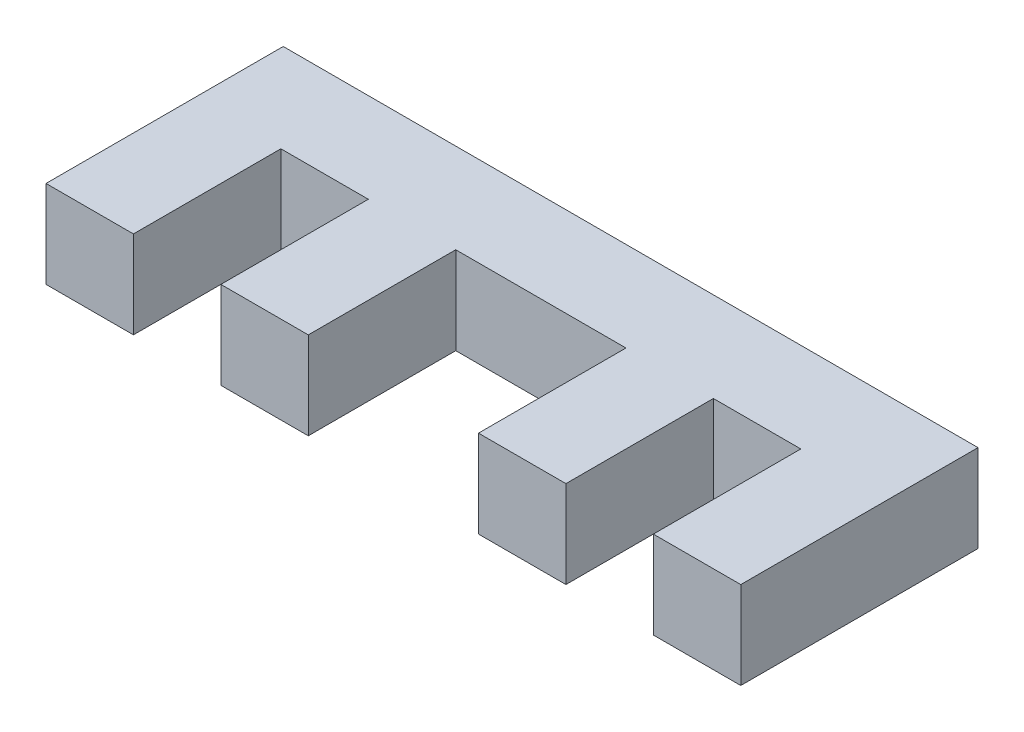
ISO-10303-21;
HEADER;
FILE_DESCRIPTION(('STEP AP214'),'2;1');
FILE_NAME('part.step','',(''),(''),'','','');
FILE_SCHEMA(('AUTOMOTIVE_DESIGN { 1 0 10303 214 1 1 1 1 }'));
ENDSEC;
DATA;
#1=APPLICATION_CONTEXT('core data for automotive mechanical design processes');
#2=APPLICATION_PROTOCOL_DEFINITION('international standard','automotive_design',2000,#1);
#3=PRODUCT_CONTEXT('',#1,'mechanical');
#4=PRODUCT('Part','Part','',(#3));
#5=PRODUCT_RELATED_PRODUCT_CATEGORY('part','',(#4));
#6=PRODUCT_DEFINITION_FORMATION('','',#4);
#7=PRODUCT_DEFINITION_CONTEXT('part definition',#1,'design');
#8=PRODUCT_DEFINITION('design','',#6,#7);
#9=PRODUCT_DEFINITION_SHAPE('','',#8);
#10=(LENGTH_UNIT() NAMED_UNIT(*) SI_UNIT(.MILLI.,.METRE.));
#11=(NAMED_UNIT(*) PLANE_ANGLE_UNIT() SI_UNIT($,.RADIAN.));
#12=(NAMED_UNIT(*) SI_UNIT($,.STERADIAN.) SOLID_ANGLE_UNIT());
#13=UNCERTAINTY_MEASURE_WITH_UNIT(LENGTH_MEASURE(1.E-05),#10,'distance_accuracy_value','');
#14=(GEOMETRIC_REPRESENTATION_CONTEXT(3) GLOBAL_UNCERTAINTY_ASSIGNED_CONTEXT((#13)) GLOBAL_UNIT_ASSIGNED_CONTEXT((#10,
#11,#12)) REPRESENTATION_CONTEXT('',''));
#15=CARTESIAN_POINT('',(0.,0.,0.));
#16=DIRECTION('',(0.,0.,1.));
#17=DIRECTION('',(1.,0.,0.));
#18=AXIS2_PLACEMENT_3D('',#15,#16,#17);
#19=CARTESIAN_POINT('',(0.,3.175,-8.61483333333333));
#20=DIRECTION('',(1.,0.,0.));
#21=DIRECTION('',(0.,0.,-1.));
#22=AXIS2_PLACEMENT_3D('',#19,#20,#21);
#23=PLANE('',#22);
#24=DIRECTION('',(0.,0.,1.));
#25=VECTOR('',#24,1.);
#26=CARTESIAN_POINT('',(0.,0.,-8.61483333333333));
#27=LINE('',#26,#25);
#28=CARTESIAN_POINT('',(0.,0.,-8.61483333333333));
#29=VERTEX_POINT('',#28);
#30=CARTESIAN_POINT('',(0.,0.,0.));
#31=VERTEX_POINT('',#30);
#32=EDGE_CURVE('E180',#29,#31,#27,.T.);
#33=ORIENTED_EDGE('',*,*,#32,.T.);
#34=DIRECTION('',(0.,-1.,0.));
#35=VECTOR('',#34,1.);
#36=CARTESIAN_POINT('',(0.,3.175,0.));
#37=LINE('',#36,#35);
#38=CARTESIAN_POINT('',(0.,3.175,0.));
#39=VERTEX_POINT('',#38);
#40=EDGE_CURVE('E11',#39,#31,#37,.T.);
#41=ORIENTED_EDGE('',*,*,#40,.F.);
#42=DIRECTION('',(0.,0.,1.));
#43=VECTOR('',#42,1.);
#44=CARTESIAN_POINT('',(0.,3.175,-8.61483333333333));
#45=LINE('',#44,#43);
#46=CARTESIAN_POINT('',(0.,3.175,-8.61483333333333));
#47=VERTEX_POINT('',#46);
#48=EDGE_CURVE('E210',#47,#39,#45,.T.);
#49=ORIENTED_EDGE('',*,*,#48,.F.);
#50=DIRECTION('',(0.,-1.,0.));
#51=VECTOR('',#50,1.);
#52=CARTESIAN_POINT('',(0.,3.175,-8.61483333333333));
#53=LINE('',#52,#51);
#54=EDGE_CURVE('E176',#47,#29,#53,.T.);
#55=ORIENTED_EDGE('',*,*,#54,.T.);
#56=EDGE_LOOP('',(#33,#41,#49,#55));
#57=FACE_BOUND('',#56,.T.);
#58=ADVANCED_FACE('F36',(#57),#23,.F.);
#59=CARTESIAN_POINT('',(0.,3.175,0.));
#60=DIRECTION('',(0.,0.,-1.));
#61=DIRECTION('',(-1.,0.,0.));
#62=AXIS2_PLACEMENT_3D('',#59,#60,#61);
#63=PLANE('',#62);
#64=DIRECTION('',(1.,0.,0.));
#65=VECTOR('',#64,1.);
#66=CARTESIAN_POINT('',(0.,0.,0.));
#67=LINE('',#66,#65);
#68=CARTESIAN_POINT('',(3.175,0.,0.));
#69=VERTEX_POINT('',#68);
#70=EDGE_CURVE('E183',#31,#69,#67,.T.);
#71=ORIENTED_EDGE('',*,*,#70,.T.);
#72=DIRECTION('',(0.,-1.,0.));
#73=VECTOR('',#72,1.);
#74=CARTESIAN_POINT('',(3.175,3.175,0.));
#75=LINE('',#74,#73);
#76=CARTESIAN_POINT('',(3.175,3.175,0.));
#77=VERTEX_POINT('',#76);
#78=EDGE_CURVE('E44',#77,#69,#75,.T.);
#79=ORIENTED_EDGE('',*,*,#78,.F.);
#80=DIRECTION('',(1.,0.,0.));
#81=VECTOR('',#80,1.);
#82=CARTESIAN_POINT('',(0.,3.175,0.));
#83=LINE('',#82,#81);
#84=EDGE_CURVE('E119',#39,#77,#83,.T.);
#85=ORIENTED_EDGE('',*,*,#84,.F.);
#86=ORIENTED_EDGE('',*,*,#40,.T.);
#87=EDGE_LOOP('',(#71,#79,#85,#86));
#88=FACE_BOUND('',#87,.T.);
#89=ADVANCED_FACE('F308',(#88),#63,.F.);
#90=CARTESIAN_POINT('',(3.175,3.175,0.));
#91=DIRECTION('',(-1.,0.,0.));
#92=DIRECTION('',(0.,0.,1.));
#93=AXIS2_PLACEMENT_3D('',#90,#91,#92);
#94=PLANE('',#93);
#95=DIRECTION('',(0.,0.,-1.));
#96=VECTOR('',#95,1.);
#97=CARTESIAN_POINT('',(3.175,0.,0.));
#98=LINE('',#97,#96);
#99=CARTESIAN_POINT('',(3.175,0.,-5.35516666666666));
#100=VERTEX_POINT('',#99);
#101=EDGE_CURVE('E185',#69,#100,#98,.T.);
#102=ORIENTED_EDGE('',*,*,#101,.T.);
#103=DIRECTION('',(0.,-1.,0.));
#104=VECTOR('',#103,1.);
#105=CARTESIAN_POINT('',(3.175,3.175,-5.35516666666666));
#106=LINE('',#105,#104);
#107=CARTESIAN_POINT('',(3.175,3.175,-5.35516666666666));
#108=VERTEX_POINT('',#107);
#109=EDGE_CURVE('E241',#108,#100,#106,.T.);
#110=ORIENTED_EDGE('',*,*,#109,.F.);
#111=DIRECTION('',(0.,0.,-1.));
#112=VECTOR('',#111,1.);
#113=CARTESIAN_POINT('',(3.175,3.175,0.));
#114=LINE('',#113,#112);
#115=EDGE_CURVE('E249',#77,#108,#114,.T.);
#116=ORIENTED_EDGE('',*,*,#115,.F.);
#117=ORIENTED_EDGE('',*,*,#78,.T.);
#118=EDGE_LOOP('',(#102,#110,#116,#117));
#119=FACE_BOUND('',#118,.T.);
#120=ADVANCED_FACE('F247',(#119),#94,.F.);
#121=CARTESIAN_POINT('',(3.175,3.175,-5.35516666666666));
#122=DIRECTION('',(0.,0.,-1.));
#123=DIRECTION('',(-1.,0.,0.));
#124=AXIS2_PLACEMENT_3D('',#121,#122,#123);
#125=PLANE('',#124);
#126=DIRECTION('',(1.,0.,0.));
#127=VECTOR('',#126,1.);
#128=CARTESIAN_POINT('',(3.175,0.,-5.35516666666666));
#129=LINE('',#128,#127);
#130=CARTESIAN_POINT('',(6.35,0.,-5.35516666666666));
#131=VERTEX_POINT('',#130);
#132=EDGE_CURVE('E187',#100,#131,#129,.T.);
#133=ORIENTED_EDGE('',*,*,#132,.T.);
#134=DIRECTION('',(0.,-1.,0.));
#135=VECTOR('',#134,1.);
#136=CARTESIAN_POINT('',(6.35,3.175,-5.35516666666666));
#137=LINE('',#136,#135);
#138=CARTESIAN_POINT('',(6.35,3.175,-5.35516666666666));
#139=VERTEX_POINT('',#138);
#140=EDGE_CURVE('E238',#139,#131,#137,.T.);
#141=ORIENTED_EDGE('',*,*,#140,.F.);
#142=DIRECTION('',(1.,0.,0.));
#143=VECTOR('',#142,1.);
#144=CARTESIAN_POINT('',(3.175,3.175,-5.35516666666666));
#145=LINE('',#144,#143);
#146=EDGE_CURVE('E267',#108,#139,#145,.T.);
#147=ORIENTED_EDGE('',*,*,#146,.F.);
#148=ORIENTED_EDGE('',*,*,#109,.T.);
#149=EDGE_LOOP('',(#133,#141,#147,#148));
#150=FACE_BOUND('',#149,.T.);
#151=ADVANCED_FACE('F258',(#150),#125,.F.);
#152=CARTESIAN_POINT('',(6.35,3.175,-5.35516666666666));
#153=DIRECTION('',(1.,0.,0.));
#154=DIRECTION('',(0.,0.,-1.));
#155=AXIS2_PLACEMENT_3D('',#152,#153,#154);
#156=PLANE('',#155);
#157=DIRECTION('',(0.,0.,1.));
#158=VECTOR('',#157,1.);
#159=CARTESIAN_POINT('',(6.35,0.,-5.35516666666666));
#160=LINE('',#159,#158);
#161=CARTESIAN_POINT('',(6.35,0.,0.));
#162=VERTEX_POINT('',#161);
#163=EDGE_CURVE('E189',#131,#162,#160,.T.);
#164=ORIENTED_EDGE('',*,*,#163,.T.);
#165=DIRECTION('',(0.,-1.,0.));
#166=VECTOR('',#165,1.);
#167=CARTESIAN_POINT('',(6.35,3.175,0.));
#168=LINE('',#167,#166);
#169=CARTESIAN_POINT('',(6.35,3.175,0.));
#170=VERTEX_POINT('',#169);
#171=EDGE_CURVE('E235',#170,#162,#168,.T.);
#172=ORIENTED_EDGE('',*,*,#171,.F.);
#173=DIRECTION('',(0.,0.,1.));
#174=VECTOR('',#173,1.);
#175=CARTESIAN_POINT('',(6.35,3.175,-5.35516666666666));
#176=LINE('',#175,#174);
#177=EDGE_CURVE('E264',#139,#170,#176,.T.);
#178=ORIENTED_EDGE('',*,*,#177,.F.);
#179=ORIENTED_EDGE('',*,*,#140,.T.);
#180=EDGE_LOOP('',(#164,#172,#178,#179));
#181=FACE_BOUND('',#180,.T.);
#182=ADVANCED_FACE('F262',(#181),#156,.F.);
#183=CARTESIAN_POINT('',(6.35,3.175,0.));
#184=DIRECTION('',(0.,0.,-1.));
#185=DIRECTION('',(-1.,0.,0.));
#186=AXIS2_PLACEMENT_3D('',#183,#184,#185);
#187=PLANE('',#186);
#188=DIRECTION('',(1.,0.,0.));
#189=VECTOR('',#188,1.);
#190=CARTESIAN_POINT('',(6.35,0.,0.));
#191=LINE('',#190,#189);
#192=CARTESIAN_POINT('',(9.525,0.,0.));
#193=VERTEX_POINT('',#192);
#194=EDGE_CURVE('E191',#162,#193,#191,.T.);
#195=ORIENTED_EDGE('',*,*,#194,.T.);
#196=DIRECTION('',(0.,-1.,0.));
#197=VECTOR('',#196,1.);
#198=CARTESIAN_POINT('',(9.525,3.175,0.));
#199=LINE('',#198,#197);
#200=CARTESIAN_POINT('',(9.525,3.175,0.));
#201=VERTEX_POINT('',#200);
#202=EDGE_CURVE('E232',#201,#193,#199,.T.);
#203=ORIENTED_EDGE('',*,*,#202,.F.);
#204=DIRECTION('',(1.,0.,0.));
#205=VECTOR('',#204,1.);
#206=CARTESIAN_POINT('',(6.35,3.175,0.));
#207=LINE('',#206,#205);
#208=EDGE_CURVE('E266',#170,#201,#207,.T.);
#209=ORIENTED_EDGE('',*,*,#208,.F.);
#210=ORIENTED_EDGE('',*,*,#171,.T.);
#211=EDGE_LOOP('',(#195,#203,#209,#210));
#212=FACE_BOUND('',#211,.T.);
#213=ADVANCED_FACE('F321',(#212),#187,.F.);
#214=CARTESIAN_POINT('',(9.525,3.175,0.));
#215=DIRECTION('',(-1.,0.,0.));
#216=DIRECTION('',(0.,0.,1.));
#217=AXIS2_PLACEMENT_3D('',#214,#215,#216);
#218=PLANE('',#217);
#219=DIRECTION('',(0.,0.,-1.));
#220=VECTOR('',#219,1.);
#221=CARTESIAN_POINT('',(9.525,0.,0.));
#222=LINE('',#221,#220);
#223=CARTESIAN_POINT('',(9.525,0.,-5.35516666666666));
#224=VERTEX_POINT('',#223);
#225=EDGE_CURVE('E193',#193,#224,#222,.T.);
#226=ORIENTED_EDGE('',*,*,#225,.T.);
#227=DIRECTION('',(0.,-1.,0.));
#228=VECTOR('',#227,1.);
#229=CARTESIAN_POINT('',(9.525,3.175,-5.35516666666666));
#230=LINE('',#229,#228);
#231=CARTESIAN_POINT('',(9.525,3.175,-5.35516666666666));
#232=VERTEX_POINT('',#231);
#233=EDGE_CURVE('E229',#232,#224,#230,.T.);
#234=ORIENTED_EDGE('',*,*,#233,.F.);
#235=DIRECTION('',(0.,0.,-1.));
#236=VECTOR('',#235,1.);
#237=CARTESIAN_POINT('',(9.525,3.175,0.));
#238=LINE('',#237,#236);
#239=EDGE_CURVE('E269',#201,#232,#238,.T.);
#240=ORIENTED_EDGE('',*,*,#239,.F.);
#241=ORIENTED_EDGE('',*,*,#202,.T.);
#242=EDGE_LOOP('',(#226,#234,#240,#241));
#243=FACE_BOUND('',#242,.T.);
#244=ADVANCED_FACE('F324',(#243),#218,.F.);
#245=CARTESIAN_POINT('',(9.525,3.175,-5.35516666666666));
#246=DIRECTION('',(0.,0.,-1.));
#247=DIRECTION('',(-1.,0.,0.));
#248=AXIS2_PLACEMENT_3D('',#245,#246,#247);
#249=PLANE('',#248);
#250=DIRECTION('',(1.,0.,0.));
#251=VECTOR('',#250,1.);
#252=CARTESIAN_POINT('',(9.525,0.,-5.35516666666666));
#253=LINE('',#252,#251);
#254=CARTESIAN_POINT('',(15.7056666666667,0.,-5.35516666666666));
#255=VERTEX_POINT('',#254);
#256=EDGE_CURVE('E195',#224,#255,#253,.T.);
#257=ORIENTED_EDGE('',*,*,#256,.T.);
#258=DIRECTION('',(0.,-1.,0.));
#259=VECTOR('',#258,1.);
#260=CARTESIAN_POINT('',(15.7056666666667,3.175,-5.35516666666666));
#261=LINE('',#260,#259);
#262=CARTESIAN_POINT('',(15.7056666666667,3.175,-5.35516666666666));
#263=VERTEX_POINT('',#262);
#264=EDGE_CURVE('E226',#263,#255,#261,.T.);
#265=ORIENTED_EDGE('',*,*,#264,.F.);
#266=DIRECTION('',(1.,0.,0.));
#267=VECTOR('',#266,1.);
#268=CARTESIAN_POINT('',(9.525,3.175,-5.35516666666666));
#269=LINE('',#268,#267);
#270=EDGE_CURVE('E275',#232,#263,#269,.T.);
#271=ORIENTED_EDGE('',*,*,#270,.F.);
#272=ORIENTED_EDGE('',*,*,#233,.T.);
#273=EDGE_LOOP('',(#257,#265,#271,#272));
#274=FACE_BOUND('',#273,.T.);
#275=ADVANCED_FACE('F328',(#274),#249,.F.);
#276=CARTESIAN_POINT('',(15.7056666666667,3.175,-5.35516666666666));
#277=DIRECTION('',(1.,0.,0.));
#278=DIRECTION('',(0.,0.,-1.));
#279=AXIS2_PLACEMENT_3D('',#276,#277,#278);
#280=PLANE('',#279);
#281=DIRECTION('',(0.,0.,1.));
#282=VECTOR('',#281,1.);
#283=CARTESIAN_POINT('',(15.7056666666667,0.,-5.35516666666666));
#284=LINE('',#283,#282);
#285=CARTESIAN_POINT('',(15.7056666666667,0.,0.));
#286=VERTEX_POINT('',#285);
#287=EDGE_CURVE('E197',#255,#286,#284,.T.);
#288=ORIENTED_EDGE('',*,*,#287,.T.);
#289=DIRECTION('',(0.,-1.,0.));
#290=VECTOR('',#289,1.);
#291=CARTESIAN_POINT('',(15.7056666666667,3.175,0.));
#292=LINE('',#291,#290);
#293=CARTESIAN_POINT('',(15.7056666666667,3.175,0.));
#294=VERTEX_POINT('',#293);
#295=EDGE_CURVE('E223',#294,#286,#292,.T.);
#296=ORIENTED_EDGE('',*,*,#295,.F.);
#297=DIRECTION('',(0.,0.,1.));
#298=VECTOR('',#297,1.);
#299=CARTESIAN_POINT('',(15.7056666666667,3.175,-5.35516666666666));
#300=LINE('',#299,#298);
#301=EDGE_CURVE('E277',#263,#294,#300,.T.);
#302=ORIENTED_EDGE('',*,*,#301,.F.);
#303=ORIENTED_EDGE('',*,*,#264,.T.);
#304=EDGE_LOOP('',(#288,#296,#302,#303));
#305=FACE_BOUND('',#304,.T.);
#306=ADVANCED_FACE('F332',(#305),#280,.F.);
#307=CARTESIAN_POINT('',(15.7056666666667,3.175,0.));
#308=DIRECTION('',(0.,0.,-1.));
#309=DIRECTION('',(-1.,0.,0.));
#310=AXIS2_PLACEMENT_3D('',#307,#308,#309);
#311=PLANE('',#310);
#312=DIRECTION('',(1.,0.,0.));
#313=VECTOR('',#312,1.);
#314=CARTESIAN_POINT('',(15.7056666666667,0.,0.));
#315=LINE('',#314,#313);
#316=CARTESIAN_POINT('',(18.8806666666667,0.,0.));
#317=VERTEX_POINT('',#316);
#318=EDGE_CURVE('E199',#286,#317,#315,.T.);
#319=ORIENTED_EDGE('',*,*,#318,.T.);
#320=DIRECTION('',(0.,-1.,0.));
#321=VECTOR('',#320,1.);
#322=CARTESIAN_POINT('',(18.8806666666667,3.175,0.));
#323=LINE('',#322,#321);
#324=CARTESIAN_POINT('',(18.8806666666667,3.175,0.));
#325=VERTEX_POINT('',#324);
#326=EDGE_CURVE('E220',#325,#317,#323,.T.);
#327=ORIENTED_EDGE('',*,*,#326,.F.);
#328=DIRECTION('',(1.,0.,0.));
#329=VECTOR('',#328,1.);
#330=CARTESIAN_POINT('',(15.7056666666667,3.175,0.));
#331=LINE('',#330,#329);
#332=EDGE_CURVE('E279',#294,#325,#331,.T.);
#333=ORIENTED_EDGE('',*,*,#332,.F.);
#334=ORIENTED_EDGE('',*,*,#295,.T.);
#335=EDGE_LOOP('',(#319,#327,#333,#334));
#336=FACE_BOUND('',#335,.T.);
#337=ADVANCED_FACE('F336',(#336),#311,.F.);
#338=CARTESIAN_POINT('',(18.8806666666667,3.175,0.));
#339=DIRECTION('',(-1.,0.,0.));
#340=DIRECTION('',(0.,0.,1.));
#341=AXIS2_PLACEMENT_3D('',#338,#339,#340);
#342=PLANE('',#341);
#343=DIRECTION('',(0.,0.,-1.));
#344=VECTOR('',#343,1.);
#345=CARTESIAN_POINT('',(18.8806666666667,0.,0.));
#346=LINE('',#345,#344);
#347=CARTESIAN_POINT('',(18.8806666666667,0.,-5.35516666666666));
#348=VERTEX_POINT('',#347);
#349=EDGE_CURVE('E201',#317,#348,#346,.T.);
#350=ORIENTED_EDGE('',*,*,#349,.T.);
#351=DIRECTION('',(0.,-1.,0.));
#352=VECTOR('',#351,1.);
#353=CARTESIAN_POINT('',(18.8806666666667,3.175,-5.35516666666666));
#354=LINE('',#353,#352);
#355=CARTESIAN_POINT('',(18.8806666666667,3.175,-5.35516666666666));
#356=VERTEX_POINT('',#355);
#357=EDGE_CURVE('E217',#356,#348,#354,.T.);
#358=ORIENTED_EDGE('',*,*,#357,.F.);
#359=DIRECTION('',(0.,0.,-1.));
#360=VECTOR('',#359,1.);
#361=CARTESIAN_POINT('',(18.8806666666667,3.175,0.));
#362=LINE('',#361,#360);
#363=EDGE_CURVE('E281',#325,#356,#362,.T.);
#364=ORIENTED_EDGE('',*,*,#363,.F.);
#365=ORIENTED_EDGE('',*,*,#326,.T.);
#366=EDGE_LOOP('',(#350,#358,#364,#365));
#367=FACE_BOUND('',#366,.T.);
#368=ADVANCED_FACE('F340',(#367),#342,.F.);
#369=CARTESIAN_POINT('',(18.8806666666667,3.175,-5.35516666666666));
#370=DIRECTION('',(0.,0.,-1.));
#371=DIRECTION('',(-1.,0.,0.));
#372=AXIS2_PLACEMENT_3D('',#369,#370,#371);
#373=PLANE('',#372);
#374=DIRECTION('',(1.,0.,0.));
#375=VECTOR('',#374,1.);
#376=CARTESIAN_POINT('',(18.8806666666667,0.,-5.35516666666666));
#377=LINE('',#376,#375);
#378=CARTESIAN_POINT('',(22.0556666666667,0.,-5.35516666666666));
#379=VERTEX_POINT('',#378);
#380=EDGE_CURVE('E203',#348,#379,#377,.T.);
#381=ORIENTED_EDGE('',*,*,#380,.T.);
#382=DIRECTION('',(0.,-1.,0.));
#383=VECTOR('',#382,1.);
#384=CARTESIAN_POINT('',(22.0556666666667,3.175,-5.35516666666666));
#385=LINE('',#384,#383);
#386=CARTESIAN_POINT('',(22.0556666666667,3.175,-5.35516666666666));
#387=VERTEX_POINT('',#386);
#388=EDGE_CURVE('E214',#387,#379,#385,.T.);
#389=ORIENTED_EDGE('',*,*,#388,.F.);
#390=DIRECTION('',(1.,0.,0.));
#391=VECTOR('',#390,1.);
#392=CARTESIAN_POINT('',(18.8806666666667,3.175,-5.35516666666666));
#393=LINE('',#392,#391);
#394=EDGE_CURVE('E283',#356,#387,#393,.T.);
#395=ORIENTED_EDGE('',*,*,#394,.F.);
#396=ORIENTED_EDGE('',*,*,#357,.T.);
#397=EDGE_LOOP('',(#381,#389,#395,#396));
#398=FACE_BOUND('',#397,.T.);
#399=ADVANCED_FACE('F289',(#398),#373,.F.);
#400=CARTESIAN_POINT('',(22.0556666666667,3.175,-5.35516666666666));
#401=DIRECTION('',(1.,0.,0.));
#402=DIRECTION('',(0.,0.,-1.));
#403=AXIS2_PLACEMENT_3D('',#400,#401,#402);
#404=PLANE('',#403);
#405=DIRECTION('',(0.,0.,1.));
#406=VECTOR('',#405,1.);
#407=CARTESIAN_POINT('',(22.0556666666667,0.,-5.35516666666666));
#408=LINE('',#407,#406);
#409=CARTESIAN_POINT('',(22.0556666666667,0.,0.));
#410=VERTEX_POINT('',#409);
#411=EDGE_CURVE('E205',#379,#410,#408,.T.);
#412=ORIENTED_EDGE('',*,*,#411,.T.);
#413=DIRECTION('',(0.,-1.,0.));
#414=VECTOR('',#413,1.);
#415=CARTESIAN_POINT('',(22.0556666666667,3.175,0.));
#416=LINE('',#415,#414);
#417=CARTESIAN_POINT('',(22.0556666666667,3.175,0.));
#418=VERTEX_POINT('',#417);
#419=EDGE_CURVE('E171',#418,#410,#416,.T.);
#420=ORIENTED_EDGE('',*,*,#419,.F.);
#421=DIRECTION('',(0.,0.,1.));
#422=VECTOR('',#421,1.);
#423=CARTESIAN_POINT('',(22.0556666666667,3.175,-5.35516666666666));
#424=LINE('',#423,#422);
#425=EDGE_CURVE('E162',#387,#418,#424,.T.);
#426=ORIENTED_EDGE('',*,*,#425,.F.);
#427=ORIENTED_EDGE('',*,*,#388,.T.);
#428=EDGE_LOOP('',(#412,#420,#426,#427));
#429=FACE_BOUND('',#428,.T.);
#430=ADVANCED_FACE('F293',(#429),#404,.F.);
#431=CARTESIAN_POINT('',(22.0556666666667,3.175,0.));
#432=DIRECTION('',(0.,0.,-1.));
#433=DIRECTION('',(-1.,0.,0.));
#434=AXIS2_PLACEMENT_3D('',#431,#432,#433);
#435=PLANE('',#434);
#436=DIRECTION('',(1.,0.,0.));
#437=VECTOR('',#436,1.);
#438=CARTESIAN_POINT('',(22.0556666666667,0.,0.));
#439=LINE('',#438,#437);
#440=CARTESIAN_POINT('',(25.2306666666667,0.,0.));
#441=VERTEX_POINT('',#440);
#442=EDGE_CURVE('E170',#410,#441,#439,.T.);
#443=ORIENTED_EDGE('',*,*,#442,.T.);
#444=DIRECTION('',(0.,-1.,0.));
#445=VECTOR('',#444,1.);
#446=CARTESIAN_POINT('',(25.2306666666667,3.175,0.));
#447=LINE('',#446,#445);
#448=CARTESIAN_POINT('',(25.2306666666667,3.175,0.));
#449=VERTEX_POINT('',#448);
#450=EDGE_CURVE('E167',#449,#441,#447,.T.);
#451=ORIENTED_EDGE('',*,*,#450,.F.);
#452=DIRECTION('',(1.,0.,0.));
#453=VECTOR('',#452,1.);
#454=CARTESIAN_POINT('',(22.0556666666667,3.175,0.));
#455=LINE('',#454,#453);
#456=EDGE_CURVE('E156',#418,#449,#455,.T.);
#457=ORIENTED_EDGE('',*,*,#456,.F.);
#458=ORIENTED_EDGE('',*,*,#419,.T.);
#459=EDGE_LOOP('',(#443,#451,#457,#458));
#460=FACE_BOUND('',#459,.T.);
#461=ADVANCED_FACE('F168',(#460),#435,.F.);
#462=CARTESIAN_POINT('',(25.2306666666667,3.175,0.));
#463=DIRECTION('',(-1.,0.,0.));
#464=DIRECTION('',(0.,0.,1.));
#465=AXIS2_PLACEMENT_3D('',#462,#463,#464);
#466=PLANE('',#465);
#467=DIRECTION('',(0.,0.,-1.));
#468=VECTOR('',#467,1.);
#469=CARTESIAN_POINT('',(25.2306666666667,0.,0.));
#470=LINE('',#469,#468);
#471=CARTESIAN_POINT('',(25.2306666666667,0.,-8.61483333333333));
#472=VERTEX_POINT('',#471);
#473=EDGE_CURVE('E105',#441,#472,#470,.T.);
#474=ORIENTED_EDGE('',*,*,#473,.T.);
#475=DIRECTION('',(0.,-1.,0.));
#476=VECTOR('',#475,1.);
#477=CARTESIAN_POINT('',(25.2306666666667,3.175,-8.61483333333333));
#478=LINE('',#477,#476);
#479=CARTESIAN_POINT('',(25.2306666666667,3.175,-8.61483333333333));
#480=VERTEX_POINT('',#479);
#481=EDGE_CURVE('E172',#480,#472,#478,.T.);
#482=ORIENTED_EDGE('',*,*,#481,.F.);
#483=DIRECTION('',(0.,0.,-1.));
#484=VECTOR('',#483,1.);
#485=CARTESIAN_POINT('',(25.2306666666667,3.175,0.));
#486=LINE('',#485,#484);
#487=EDGE_CURVE('E160',#449,#480,#486,.T.);
#488=ORIENTED_EDGE('',*,*,#487,.F.);
#489=ORIENTED_EDGE('',*,*,#450,.T.);
#490=EDGE_LOOP('',(#474,#482,#488,#489));
#491=FACE_BOUND('',#490,.T.);
#492=ADVANCED_FACE('F174',(#491),#466,.F.);
#493=CARTESIAN_POINT('',(25.2306666666667,3.175,-8.61483333333333));
#494=DIRECTION('',(0.,0.,1.));
#495=DIRECTION('',(1.,0.,0.));
#496=AXIS2_PLACEMENT_3D('',#493,#494,#495);
#497=PLANE('',#496);
#498=DIRECTION('',(-1.,0.,0.));
#499=VECTOR('',#498,1.);
#500=CARTESIAN_POINT('',(25.2306666666667,0.,-8.61483333333333));
#501=LINE('',#500,#499);
#502=EDGE_CURVE('E111',#472,#29,#501,.T.);
#503=ORIENTED_EDGE('',*,*,#502,.T.);
#504=ORIENTED_EDGE('',*,*,#54,.F.);
#505=DIRECTION('',(-1.,0.,0.));
#506=VECTOR('',#505,1.);
#507=CARTESIAN_POINT('',(25.2306666666667,3.175,-8.61483333333333));
#508=LINE('',#507,#506);
#509=EDGE_CURVE('E52',#480,#47,#508,.T.);
#510=ORIENTED_EDGE('',*,*,#509,.F.);
#511=ORIENTED_EDGE('',*,*,#481,.T.);
#512=EDGE_LOOP('',(#503,#504,#510,#511));
#513=FACE_BOUND('',#512,.T.);
#514=ADVANCED_FACE('F297',(#513),#497,.F.);
#515=CARTESIAN_POINT('',(0.,3.175,0.));
#516=DIRECTION('',(0.,1.,0.));
#517=DIRECTION('',(0.,0.,1.));
#518=AXIS2_PLACEMENT_3D('',#515,#516,#517);
#519=PLANE('',#518);
#520=ORIENTED_EDGE('',*,*,#48,.T.);
#521=ORIENTED_EDGE('',*,*,#84,.T.);
#522=ORIENTED_EDGE('',*,*,#115,.T.);
#523=ORIENTED_EDGE('',*,*,#146,.T.);
#524=ORIENTED_EDGE('',*,*,#177,.T.);
#525=ORIENTED_EDGE('',*,*,#208,.T.);
#526=ORIENTED_EDGE('',*,*,#239,.T.);
#527=ORIENTED_EDGE('',*,*,#270,.T.);
#528=ORIENTED_EDGE('',*,*,#301,.T.);
#529=ORIENTED_EDGE('',*,*,#332,.T.);
#530=ORIENTED_EDGE('',*,*,#363,.T.);
#531=ORIENTED_EDGE('',*,*,#394,.T.);
#532=ORIENTED_EDGE('',*,*,#425,.T.);
#533=ORIENTED_EDGE('',*,*,#456,.T.);
#534=ORIENTED_EDGE('',*,*,#487,.T.);
#535=ORIENTED_EDGE('',*,*,#509,.T.);
#536=EDGE_LOOP('',(#520,#521,#522,#523,#524,#525,#526,#527,#528,#529,#530,#531,#532,#533,#534,#535));
#537=FACE_BOUND('',#536,.T.);
#538=ADVANCED_FACE('F158',(#537),#519,.T.);
#539=CARTESIAN_POINT('',(0.,0.,0.));
#540=DIRECTION('',(0.,1.,0.));
#541=DIRECTION('',(0.,0.,1.));
#542=AXIS2_PLACEMENT_3D('',#539,#540,#541);
#543=PLANE('',#542);
#544=ORIENTED_EDGE('',*,*,#32,.F.);
#545=ORIENTED_EDGE('',*,*,#502,.F.);
#546=ORIENTED_EDGE('',*,*,#473,.F.);
#547=ORIENTED_EDGE('',*,*,#442,.F.);
#548=ORIENTED_EDGE('',*,*,#411,.F.);
#549=ORIENTED_EDGE('',*,*,#380,.F.);
#550=ORIENTED_EDGE('',*,*,#349,.F.);
#551=ORIENTED_EDGE('',*,*,#318,.F.);
#552=ORIENTED_EDGE('',*,*,#287,.F.);
#553=ORIENTED_EDGE('',*,*,#256,.F.);
#554=ORIENTED_EDGE('',*,*,#225,.F.);
#555=ORIENTED_EDGE('',*,*,#194,.F.);
#556=ORIENTED_EDGE('',*,*,#163,.F.);
#557=ORIENTED_EDGE('',*,*,#132,.F.);
#558=ORIENTED_EDGE('',*,*,#101,.F.);
#559=ORIENTED_EDGE('',*,*,#70,.F.);
#560=EDGE_LOOP('',(#544,#545,#546,#547,#548,#549,#550,#551,#552,#553,#554,#555,#556,#557,#558,#559));
#561=FACE_BOUND('',#560,.T.);
#562=ADVANCED_FACE('F253',(#561),#543,.F.);
#563=CLOSED_SHELL('',(#58,#89,#120,#151,#182,#213,#244,#275,#306,#337,#368,#399,#430,#461,#492,
#514,#538,#562));
#564=MANIFOLD_SOLID_BREP('B2',#563);
#565=ADVANCED_BREP_SHAPE_REPRESENTATION('',(#18,#564),#14);
#566=SHAPE_DEFINITION_REPRESENTATION(#9,#565);
ENDSEC;
END-ISO-10303-21;
